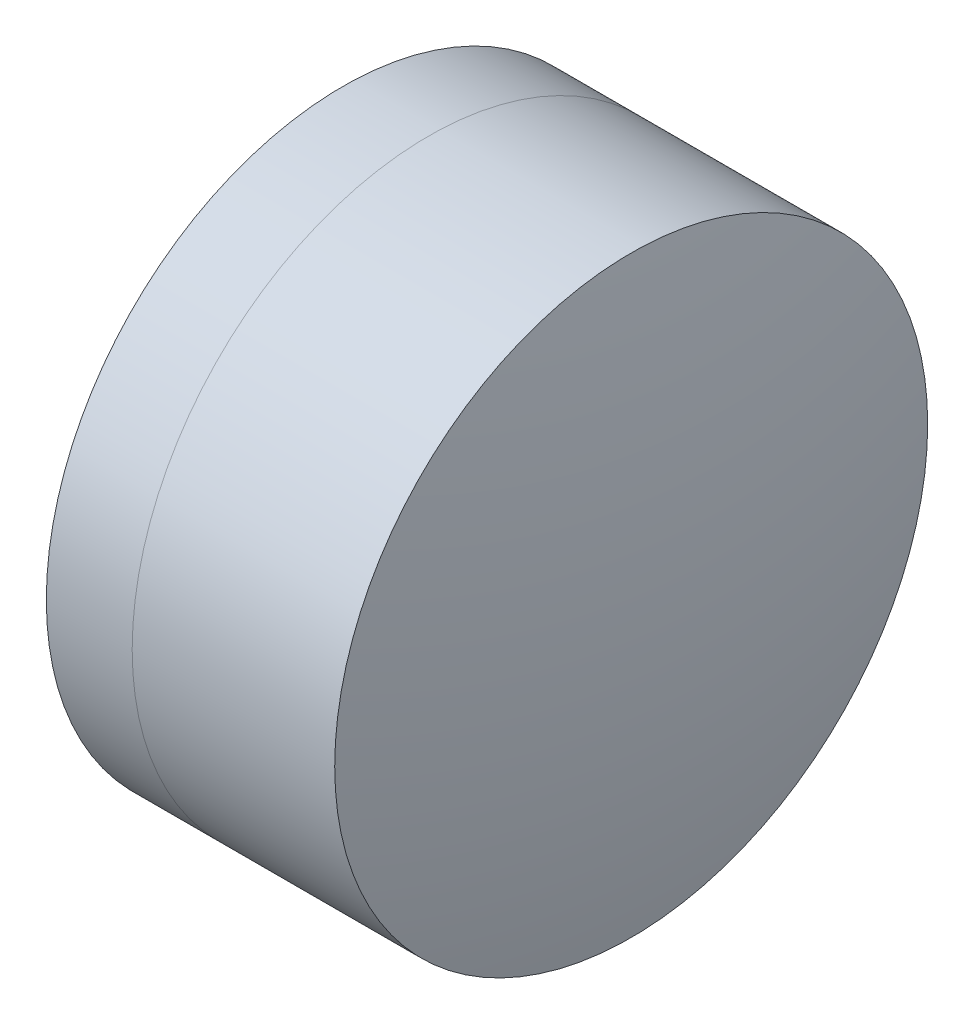
ISO-10303-21;
HEADER;
FILE_DESCRIPTION(('STEP AP214'),'2;1');
FILE_NAME('part.step','',(''),(''),'','','');
FILE_SCHEMA(('AUTOMOTIVE_DESIGN { 1 0 10303 214 1 1 1 1 }'));
ENDSEC;
DATA;
#1=APPLICATION_CONTEXT('core data for automotive mechanical design processes');
#2=APPLICATION_PROTOCOL_DEFINITION('international standard','automotive_design',2000,#1);
#3=PRODUCT_CONTEXT('',#1,'mechanical');
#4=PRODUCT('Part','Part','',(#3));
#5=PRODUCT_RELATED_PRODUCT_CATEGORY('part','',(#4));
#6=PRODUCT_DEFINITION_FORMATION('','',#4);
#7=PRODUCT_DEFINITION_CONTEXT('part definition',#1,'design');
#8=PRODUCT_DEFINITION('design','',#6,#7);
#9=PRODUCT_DEFINITION_SHAPE('','',#8);
#10=(LENGTH_UNIT() NAMED_UNIT(*) SI_UNIT(.MILLI.,.METRE.));
#11=(NAMED_UNIT(*) PLANE_ANGLE_UNIT() SI_UNIT($,.RADIAN.));
#12=(NAMED_UNIT(*) SI_UNIT($,.STERADIAN.) SOLID_ANGLE_UNIT());
#13=UNCERTAINTY_MEASURE_WITH_UNIT(LENGTH_MEASURE(1.E-05),#10,'distance_accuracy_value','');
#14=(GEOMETRIC_REPRESENTATION_CONTEXT(3) GLOBAL_UNCERTAINTY_ASSIGNED_CONTEXT((#13)) GLOBAL_UNIT_ASSIGNED_CONTEXT((#10,
#11,#12)) REPRESENTATION_CONTEXT('',''));
#15=CARTESIAN_POINT('',(0.,0.,0.));
#16=DIRECTION('',(0.,0.,1.));
#17=DIRECTION('',(1.,0.,0.));
#18=AXIS2_PLACEMENT_3D('',#15,#16,#17);
#19=CARTESIAN_POINT('',(-6.62917567080411,0.,0.));
#20=DIRECTION('',(-1.,0.,0.));
#21=DIRECTION('',(0.,0.,1.));
#22=AXIS2_PLACEMENT_3D('',#19,#20,#21);
#23=SPHERICAL_SURFACE('',#22,7.066);
#24=CARTESIAN_POINT('',(-0.804370438008772,0.,0.));
#25=DIRECTION('',(-1.,0.,0.));
#26=DIRECTION('',(0.,0.,1.));
#27=AXIS2_PLACEMENT_3D('',#24,#25,#26);
#28=CIRCLE('',#27,4.);
#29=CARTESIAN_POINT('',(-0.804370438008772,0.,4.));
#30=VERTEX_POINT('',#29);
#31=EDGE_CURVE('E11',#30,#30,#28,.T.);
#32=ORIENTED_EDGE('',*,*,#31,.T.);
#33=EDGE_LOOP('',(#32));
#34=FACE_BOUND('',#33,.T.);
#35=ADVANCED_FACE('F53',(#34),#23,.F.);
#36=CARTESIAN_POINT('',(-0.551919992657797,0.,0.));
#37=DIRECTION('',(-1.,0.,0.));
#38=DIRECTION('',(0.,0.,1.));
#39=AXIS2_PLACEMENT_3D('',#36,#37,#38);
#40=CYLINDRICAL_SURFACE('',#39,4.);
#41=CARTESIAN_POINT('',(1.92797511491345,0.,0.));
#42=DIRECTION('',(-1.,0.,0.));
#43=DIRECTION('',(0.,0.,1.));
#44=AXIS2_PLACEMENT_3D('',#41,#42,#43);
#45=CIRCLE('',#44,4.);
#46=CARTESIAN_POINT('',(1.92797511491345,0.,4.));
#47=VERTEX_POINT('',#46);
#48=EDGE_CURVE('E60',#47,#47,#45,.T.);
#49=ORIENTED_EDGE('',*,*,#48,.T.);
#50=EDGE_LOOP('',(#49));
#51=FACE_BOUND('',#50,.T.);
#52=ORIENTED_EDGE('',*,*,#31,.F.);
#53=EDGE_LOOP('',(#52));
#54=FACE_BOUND('',#53,.T.);
#55=ADVANCED_FACE('F67',(#51,#54),#40,.T.);
#56=CARTESIAN_POINT('',(-16.5121756708041,0.,0.));
#57=DIRECTION('',(-1.,0.,0.));
#58=DIRECTION('',(0.,0.,1.));
#59=AXIS2_PLACEMENT_3D('',#56,#57,#58);
#60=SPHERICAL_SURFACE('',#59,18.869);
#61=ORIENTED_EDGE('',*,*,#48,.F.);
#62=EDGE_LOOP('',(#61));
#63=FACE_BOUND('',#62,.T.);
#64=ADVANCED_FACE('F70',(#63),#60,.T.);
#65=CLOSED_SHELL('',(#35,#55,#64));
#66=MANIFOLD_SOLID_BREP('B2',#65);
#67=CARTESIAN_POINT('',(7.89882432919588,0.,0.));
#68=DIRECTION('',(-1.,0.,0.));
#69=DIRECTION('',(0.,0.,1.));
#70=AXIS2_PLACEMENT_3D('',#67,#68,#69);
#71=SPHERICAL_SURFACE('',#70,10.642);
#72=CARTESIAN_POINT('',(-1.96282685100715,0.,0.));
#73=DIRECTION('',(-1.,0.,0.));
#74=DIRECTION('',(0.,0.,1.));
#75=AXIS2_PLACEMENT_3D('',#72,#73,#74);
#76=CIRCLE('',#75,4.);
#77=CARTESIAN_POINT('',(-1.96282685100715,0.,4.));
#78=VERTEX_POINT('',#77);
#79=EDGE_CURVE('E52',#78,#78,#76,.T.);
#80=ORIENTED_EDGE('',*,*,#79,.T.);
#81=EDGE_LOOP('',(#80));
#82=FACE_BOUND('',#81,.T.);
#83=ADVANCED_FACE('F101',(#82),#71,.T.);
#84=CARTESIAN_POINT('',(-9.70261217833668,0.,0.));
#85=DIRECTION('',(-1.,0.,0.));
#86=DIRECTION('',(0.,0.,1.));
#87=AXIS2_PLACEMENT_3D('',#84,#85,#86);
#88=CYLINDRICAL_SURFACE('',#87,4.);
#89=CARTESIAN_POINT('',(-0.804370438008772,0.,0.));
#90=DIRECTION('',(-1.,0.,0.));
#91=DIRECTION('',(0.,0.,1.));
#92=AXIS2_PLACEMENT_3D('',#89,#90,#91);
#93=CIRCLE('',#92,4.);
#94=CARTESIAN_POINT('',(-0.804370438008772,0.,4.));
#95=VERTEX_POINT('',#94);
#96=EDGE_CURVE('E108',#95,#95,#93,.T.);
#97=ORIENTED_EDGE('',*,*,#96,.T.);
#98=EDGE_LOOP('',(#97));
#99=FACE_BOUND('',#98,.T.);
#100=ORIENTED_EDGE('',*,*,#79,.F.);
#101=EDGE_LOOP('',(#100));
#102=FACE_BOUND('',#101,.T.);
#103=ADVANCED_FACE('F115',(#99,#102),#88,.T.);
#104=CARTESIAN_POINT('',(-6.62917567080411,0.,0.));
#105=DIRECTION('',(-1.,0.,0.));
#106=DIRECTION('',(0.,0.,1.));
#107=AXIS2_PLACEMENT_3D('',#104,#105,#106);
#108=SPHERICAL_SURFACE('',#107,7.066);
#109=ORIENTED_EDGE('',*,*,#96,.F.);
#110=EDGE_LOOP('',(#109));
#111=FACE_BOUND('',#110,.T.);
#112=ADVANCED_FACE('F118',(#111),#108,.T.);
#113=CLOSED_SHELL('',(#83,#103,#112));
#114=MANIFOLD_SOLID_BREP('B6',#113);
#115=ADVANCED_BREP_SHAPE_REPRESENTATION('',(#18,#66,#114),#14);
#116=SHAPE_DEFINITION_REPRESENTATION(#9,#115);
ENDSEC;
END-ISO-10303-21;
